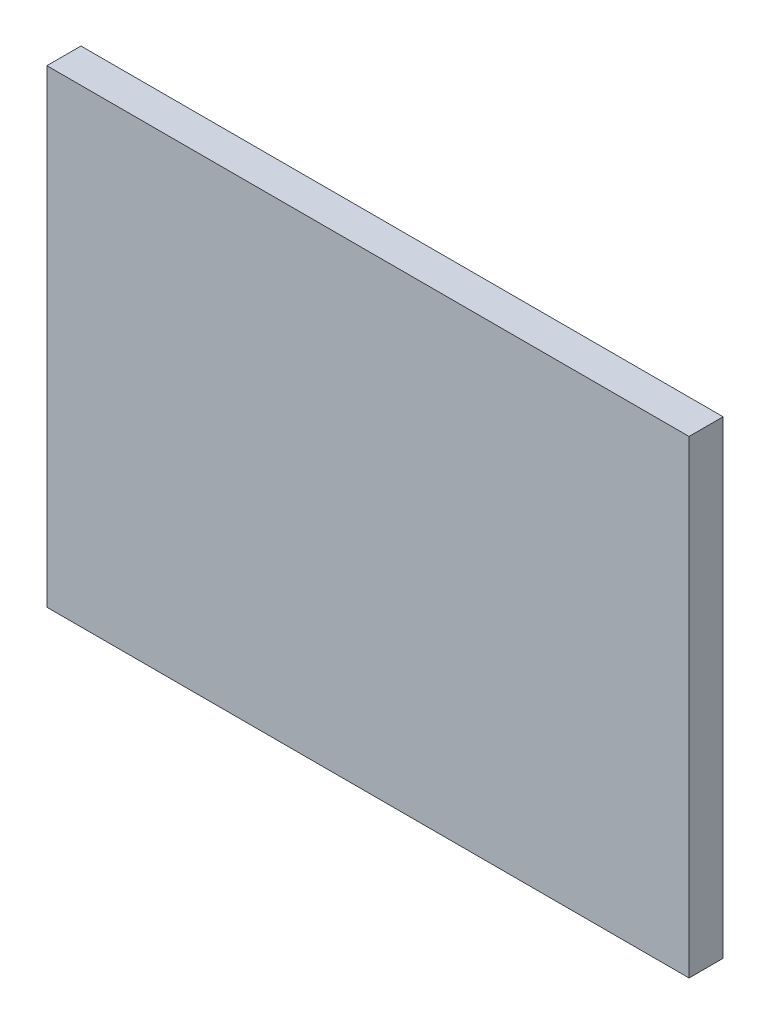
ISO-10303-21;
HEADER;
FILE_DESCRIPTION(('STEP AP214'),'2;1');
FILE_NAME('part.step','',(''),(''),'','','');
FILE_SCHEMA(('AUTOMOTIVE_DESIGN { 1 0 10303 214 1 1 1 1 }'));
ENDSEC;
DATA;
#1=APPLICATION_CONTEXT('core data for automotive mechanical design processes');
#2=APPLICATION_PROTOCOL_DEFINITION('international standard','automotive_design',2000,#1);
#3=PRODUCT_CONTEXT('',#1,'mechanical');
#4=PRODUCT('Part','Part','',(#3));
#5=PRODUCT_RELATED_PRODUCT_CATEGORY('part','',(#4));
#6=PRODUCT_DEFINITION_FORMATION('','',#4);
#7=PRODUCT_DEFINITION_CONTEXT('part definition',#1,'design');
#8=PRODUCT_DEFINITION('design','',#6,#7);
#9=PRODUCT_DEFINITION_SHAPE('','',#8);
#10=(LENGTH_UNIT() NAMED_UNIT(*) SI_UNIT(.MILLI.,.METRE.));
#11=(NAMED_UNIT(*) PLANE_ANGLE_UNIT() SI_UNIT($,.RADIAN.));
#12=(NAMED_UNIT(*) SI_UNIT($,.STERADIAN.) SOLID_ANGLE_UNIT());
#13=UNCERTAINTY_MEASURE_WITH_UNIT(LENGTH_MEASURE(1.E-05),#10,'distance_accuracy_value','');
#14=(GEOMETRIC_REPRESENTATION_CONTEXT(3) GLOBAL_UNCERTAINTY_ASSIGNED_CONTEXT((#13)) GLOBAL_UNIT_ASSIGNED_CONTEXT((#10,
#11,#12)) REPRESENTATION_CONTEXT('',''));
#15=CARTESIAN_POINT('',(0.,0.,0.));
#16=DIRECTION('',(0.,0.,1.));
#17=DIRECTION('',(1.,0.,0.));
#18=AXIS2_PLACEMENT_3D('',#15,#16,#17);
#19=CARTESIAN_POINT('',(-28.2575,-20.6375,2.99999908));
#20=DIRECTION('',(0.,0.,-1.));
#21=DIRECTION('',(-1.,0.,0.));
#22=AXIS2_PLACEMENT_3D('',#19,#20,#21);
#23=PLANE('',#22);
#24=DIRECTION('',(0.,1.,0.));
#25=VECTOR('',#24,1.);
#26=CARTESIAN_POINT('',(28.2575,-20.6375,2.99999908));
#27=LINE('',#26,#25);
#28=CARTESIAN_POINT('',(28.2575,-20.6375,2.99999908));
#29=VERTEX_POINT('',#28);
#30=CARTESIAN_POINT('',(28.2575,20.6375,2.99999908));
#31=VERTEX_POINT('',#30);
#32=EDGE_CURVE('E55',#29,#31,#27,.T.);
#33=ORIENTED_EDGE('',*,*,#32,.T.);
#34=DIRECTION('',(1.,0.,0.));
#35=VECTOR('',#34,1.);
#36=CARTESIAN_POINT('',(28.2575,20.6375,2.99999908));
#37=LINE('',#36,#35);
#38=CARTESIAN_POINT('',(-28.2575,20.6375,2.99999908));
#39=VERTEX_POINT('',#38);
#40=EDGE_CURVE('E57',#31,#39,#37,.F.);
#41=ORIENTED_EDGE('',*,*,#40,.T.);
#42=DIRECTION('',(0.,1.,0.));
#43=VECTOR('',#42,1.);
#44=CARTESIAN_POINT('',(-28.2575,20.6375,2.99999908));
#45=LINE('',#44,#43);
#46=CARTESIAN_POINT('',(-28.2575,-20.6375,2.99999908));
#47=VERTEX_POINT('',#46);
#48=EDGE_CURVE('E20',#39,#47,#45,.F.);
#49=ORIENTED_EDGE('',*,*,#48,.T.);
#50=DIRECTION('',(1.,0.,0.));
#51=VECTOR('',#50,1.);
#52=CARTESIAN_POINT('',(-28.2575,-20.6375,2.99999908));
#53=LINE('',#52,#51);
#54=EDGE_CURVE('E80',#47,#29,#53,.T.);
#55=ORIENTED_EDGE('',*,*,#54,.T.);
#56=EDGE_LOOP('',(#33,#41,#49,#55));
#57=FACE_BOUND('',#56,.T.);
#58=ADVANCED_FACE('F17',(#57),#23,.F.);
#59=CARTESIAN_POINT('',(-28.2575,20.6375,0.));
#60=DIRECTION('',(1.,0.,0.));
#61=DIRECTION('',(0.,0.,-1.));
#62=AXIS2_PLACEMENT_3D('',#59,#60,#61);
#63=PLANE('',#62);
#64=DIRECTION('',(0.,0.,1.));
#65=VECTOR('',#64,1.);
#66=CARTESIAN_POINT('',(-28.2575,-20.6375,0.));
#67=LINE('',#66,#65);
#68=CARTESIAN_POINT('',(-28.2575,-20.6375,0.));
#69=VERTEX_POINT('',#68);
#70=EDGE_CURVE('E68',#69,#47,#67,.T.);
#71=ORIENTED_EDGE('',*,*,#70,.T.);
#72=ORIENTED_EDGE('',*,*,#48,.F.);
#73=DIRECTION('',(0.,0.,-1.));
#74=VECTOR('',#73,1.);
#75=CARTESIAN_POINT('',(-28.2575,20.6375,0.));
#76=LINE('',#75,#74);
#77=CARTESIAN_POINT('',(-28.2575,20.6375,0.));
#78=VERTEX_POINT('',#77);
#79=EDGE_CURVE('E63',#39,#78,#76,.T.);
#80=ORIENTED_EDGE('',*,*,#79,.T.);
#81=DIRECTION('',(0.,1.,0.));
#82=VECTOR('',#81,1.);
#83=CARTESIAN_POINT('',(-28.2575,-20.6375,0.));
#84=LINE('',#83,#82);
#85=EDGE_CURVE('E83',#69,#78,#84,.T.);
#86=ORIENTED_EDGE('',*,*,#85,.F.);
#87=EDGE_LOOP('',(#71,#72,#80,#86));
#88=FACE_BOUND('',#87,.T.);
#89=ADVANCED_FACE('F65',(#88),#63,.F.);
#90=CARTESIAN_POINT('',(28.2575,20.6375,0.));
#91=DIRECTION('',(0.,-1.,0.));
#92=DIRECTION('',(0.,0.,-1.));
#93=AXIS2_PLACEMENT_3D('',#90,#91,#92);
#94=PLANE('',#93);
#95=ORIENTED_EDGE('',*,*,#79,.F.);
#96=ORIENTED_EDGE('',*,*,#40,.F.);
#97=DIRECTION('',(0.,0.,1.));
#98=VECTOR('',#97,1.);
#99=CARTESIAN_POINT('',(28.2575,20.6375,0.));
#100=LINE('',#99,#98);
#101=CARTESIAN_POINT('',(28.2575,20.6375,0.));
#102=VERTEX_POINT('',#101);
#103=EDGE_CURVE('E75',#31,#102,#100,.F.);
#104=ORIENTED_EDGE('',*,*,#103,.T.);
#105=DIRECTION('',(-1.,0.,0.));
#106=VECTOR('',#105,1.);
#107=CARTESIAN_POINT('',(-28.2575,20.6375,0.));
#108=LINE('',#107,#106);
#109=EDGE_CURVE('E72',#78,#102,#108,.F.);
#110=ORIENTED_EDGE('',*,*,#109,.F.);
#111=EDGE_LOOP('',(#95,#96,#104,#110));
#112=FACE_BOUND('',#111,.T.);
#113=ADVANCED_FACE('F70',(#112),#94,.F.);
#114=CARTESIAN_POINT('',(28.2575,-20.6375,0.));
#115=DIRECTION('',(-1.,0.,0.));
#116=DIRECTION('',(0.,0.,1.));
#117=AXIS2_PLACEMENT_3D('',#114,#115,#116);
#118=PLANE('',#117);
#119=ORIENTED_EDGE('',*,*,#103,.F.);
#120=ORIENTED_EDGE('',*,*,#32,.F.);
#121=DIRECTION('',(0.,0.,1.));
#122=VECTOR('',#121,1.);
#123=CARTESIAN_POINT('',(28.2575,-20.6375,0.));
#124=LINE('',#123,#122);
#125=CARTESIAN_POINT('',(28.2575,-20.6375,0.));
#126=VERTEX_POINT('',#125);
#127=EDGE_CURVE('E35',#29,#126,#124,.F.);
#128=ORIENTED_EDGE('',*,*,#127,.T.);
#129=DIRECTION('',(0.,1.,0.));
#130=VECTOR('',#129,1.);
#131=CARTESIAN_POINT('',(28.2575,-20.6375,0.));
#132=LINE('',#131,#130);
#133=EDGE_CURVE('E26',#102,#126,#132,.F.);
#134=ORIENTED_EDGE('',*,*,#133,.F.);
#135=EDGE_LOOP('',(#119,#120,#128,#134));
#136=FACE_BOUND('',#135,.T.);
#137=ADVANCED_FACE('F89',(#136),#118,.F.);
#138=CARTESIAN_POINT('',(-28.2575,-20.6375,0.));
#139=DIRECTION('',(0.,1.,0.));
#140=DIRECTION('',(0.,0.,1.));
#141=AXIS2_PLACEMENT_3D('',#138,#139,#140);
#142=PLANE('',#141);
#143=ORIENTED_EDGE('',*,*,#127,.F.);
#144=ORIENTED_EDGE('',*,*,#54,.F.);
#145=ORIENTED_EDGE('',*,*,#70,.F.);
#146=DIRECTION('',(-1.,0.,0.));
#147=VECTOR('',#146,1.);
#148=CARTESIAN_POINT('',(-28.2575,-20.6375,0.));
#149=LINE('',#148,#147);
#150=EDGE_CURVE('E11',#126,#69,#149,.T.);
#151=ORIENTED_EDGE('',*,*,#150,.F.);
#152=EDGE_LOOP('',(#143,#144,#145,#151));
#153=FACE_BOUND('',#152,.T.);
#154=ADVANCED_FACE('F91',(#153),#142,.F.);
#155=CARTESIAN_POINT('',(-28.2575,-20.6375,0.));
#156=DIRECTION('',(0.,0.,-1.));
#157=DIRECTION('',(-1.,0.,0.));
#158=AXIS2_PLACEMENT_3D('',#155,#156,#157);
#159=PLANE('',#158);
#160=ORIENTED_EDGE('',*,*,#133,.T.);
#161=ORIENTED_EDGE('',*,*,#150,.T.);
#162=ORIENTED_EDGE('',*,*,#85,.T.);
#163=ORIENTED_EDGE('',*,*,#109,.T.);
#164=EDGE_LOOP('',(#160,#161,#162,#163));
#165=FACE_BOUND('',#164,.T.);
#166=ADVANCED_FACE('F88',(#165),#159,.T.);
#167=CLOSED_SHELL('',(#58,#89,#113,#137,#154,#166));
#168=MANIFOLD_SOLID_BREP('B1',#167);
#169=ADVANCED_BREP_SHAPE_REPRESENTATION('',(#18,#168),#14);
#170=SHAPE_DEFINITION_REPRESENTATION(#9,#169);
ENDSEC;
END-ISO-10303-21;
